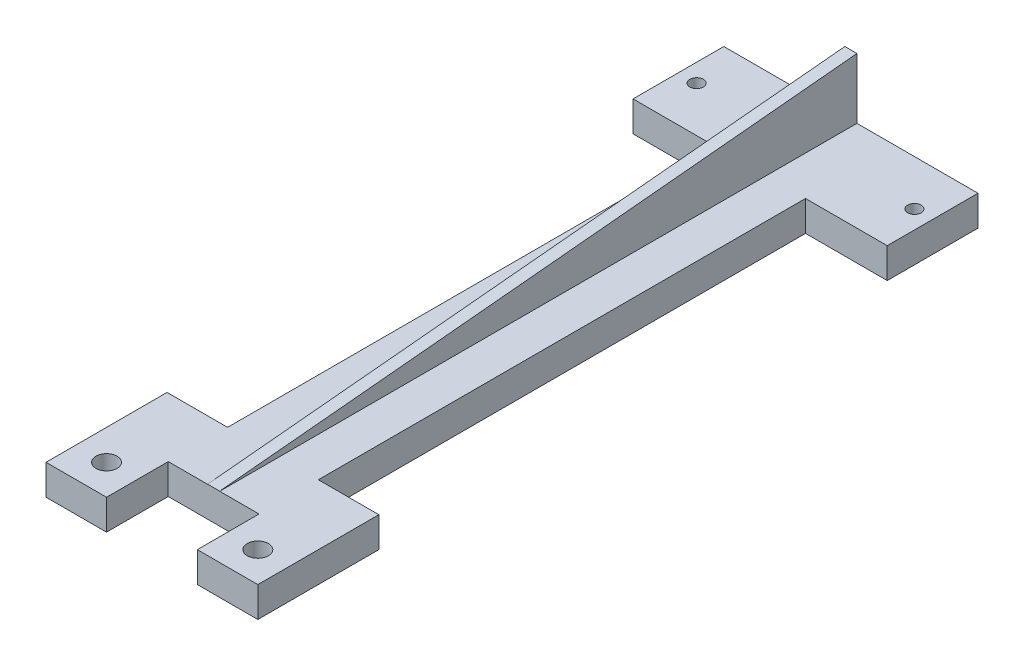
ISO-10303-21;
HEADER;
FILE_DESCRIPTION(('STEP AP214'),'2;1');
FILE_NAME('part.step','',(''),(''),'','','');
FILE_SCHEMA(('AUTOMOTIVE_DESIGN { 1 0 10303 214 1 1 1 1 }'));
ENDSEC;
DATA;
#1=APPLICATION_CONTEXT('core data for automotive mechanical design processes');
#2=APPLICATION_PROTOCOL_DEFINITION('international standard','automotive_design',2000,#1);
#3=PRODUCT_CONTEXT('',#1,'mechanical');
#4=PRODUCT('Part','Part','',(#3));
#5=PRODUCT_RELATED_PRODUCT_CATEGORY('part','',(#4));
#6=PRODUCT_DEFINITION_FORMATION('','',#4);
#7=PRODUCT_DEFINITION_CONTEXT('part definition',#1,'design');
#8=PRODUCT_DEFINITION('design','',#6,#7);
#9=PRODUCT_DEFINITION_SHAPE('','',#8);
#10=(LENGTH_UNIT() NAMED_UNIT(*) SI_UNIT(.MILLI.,.METRE.));
#11=(NAMED_UNIT(*) PLANE_ANGLE_UNIT() SI_UNIT($,.RADIAN.));
#12=(NAMED_UNIT(*) SI_UNIT($,.STERADIAN.) SOLID_ANGLE_UNIT());
#13=UNCERTAINTY_MEASURE_WITH_UNIT(LENGTH_MEASURE(1.E-05),#10,'distance_accuracy_value','');
#14=(GEOMETRIC_REPRESENTATION_CONTEXT(3) GLOBAL_UNCERTAINTY_ASSIGNED_CONTEXT((#13)) GLOBAL_UNIT_ASSIGNED_CONTEXT((#10,
#11,#12)) REPRESENTATION_CONTEXT('',''));
#15=CARTESIAN_POINT('',(0.,0.,0.));
#16=DIRECTION('',(0.,0.,1.));
#17=DIRECTION('',(1.,0.,0.));
#18=AXIS2_PLACEMENT_3D('',#15,#16,#17);
#19=CARTESIAN_POINT('',(0.,5.,0.));
#20=DIRECTION('',(0.,-1.,0.));
#21=DIRECTION('',(0.,0.,-1.));
#22=AXIS2_PLACEMENT_3D('',#19,#20,#21);
#23=PLANE('',#22);
#24=CARTESIAN_POINT('',(3.,5.,-7.5));
#25=DIRECTION('',(0.,1.,0.));
#26=DIRECTION('',(0.,0.,1.));
#27=AXIS2_PLACEMENT_3D('',#24,#25,#26);
#28=CIRCLE('',#27,1.115);
#29=CARTESIAN_POINT('',(3.,5.,-6.385));
#30=VERTEX_POINT('',#29);
#31=EDGE_CURVE('E357',#30,#30,#28,.T.);
#32=ORIENTED_EDGE('',*,*,#31,.F.);
#33=EDGE_LOOP('',(#32));
#34=FACE_BOUND('',#33,.T.);
#35=CARTESIAN_POINT('',(8.50000000000001,5.,95.5));
#36=DIRECTION('',(0.,1.,0.));
#37=DIRECTION('',(0.,0.,1.));
#38=AXIS2_PLACEMENT_3D('',#35,#36,#37);
#39=CIRCLE('',#38,1.75);
#40=CARTESIAN_POINT('',(8.50000000000001,5.,97.25));
#41=VERTEX_POINT('',#40);
#42=EDGE_CURVE('E237',#41,#41,#39,.T.);
#43=ORIENTED_EDGE('',*,*,#42,.F.);
#44=EDGE_LOOP('',(#43));
#45=FACE_BOUND('',#44,.T.);
#46=DIRECTION('',(0.,0.,1.));
#47=VECTOR('',#46,1.);
#48=CARTESIAN_POINT('',(20.,5.,-15.));
#49=LINE('',#48,#47);
#50=CARTESIAN_POINT('',(20.,5.,-15.));
#51=VERTEX_POINT('',#50);
#52=CARTESIAN_POINT('',(20.,5.,90.3));
#53=VERTEX_POINT('',#52);
#54=EDGE_CURVE('E57',#51,#53,#49,.T.);
#55=ORIENTED_EDGE('',*,*,#54,.F.);
#56=DIRECTION('',(-1.,0.,0.));
#57=VECTOR('',#56,1.);
#58=CARTESIAN_POINT('',(0.,5.,-15.));
#59=LINE('',#58,#57);
#60=CARTESIAN_POINT('',(0.,5.,-15.));
#61=VERTEX_POINT('',#60);
#62=EDGE_CURVE('E200',#51,#61,#59,.T.);
#63=ORIENTED_EDGE('',*,*,#62,.T.);
#64=DIRECTION('',(0.,0.,1.));
#65=VECTOR('',#64,1.);
#66=CARTESIAN_POINT('',(0.,5.,0.));
#67=LINE('',#66,#65);
#68=CARTESIAN_POINT('',(0.,5.,0.));
#69=VERTEX_POINT('',#68);
#70=EDGE_CURVE('E368',#61,#69,#67,.T.);
#71=ORIENTED_EDGE('',*,*,#70,.T.);
#72=DIRECTION('',(1.,0.,0.));
#73=VECTOR('',#72,1.);
#74=CARTESIAN_POINT('',(0.,5.,0.));
#75=LINE('',#74,#73);
#76=CARTESIAN_POINT('',(13.5,5.,0.));
#77=VERTEX_POINT('',#76);
#78=EDGE_CURVE('E374',#69,#77,#75,.T.);
#79=ORIENTED_EDGE('',*,*,#78,.T.);
#80=DIRECTION('',(0.,0.,1.));
#81=VECTOR('',#80,1.);
#82=CARTESIAN_POINT('',(13.5,5.,0.));
#83=LINE('',#82,#81);
#84=CARTESIAN_POINT('',(13.5,5.,80.5));
#85=VERTEX_POINT('',#84);
#86=EDGE_CURVE('E307',#77,#85,#83,.T.);
#87=ORIENTED_EDGE('',*,*,#86,.T.);
#88=DIRECTION('',(-1.,0.,0.));
#89=VECTOR('',#88,1.);
#90=CARTESIAN_POINT('',(3.50000000000001,5.,80.5));
#91=LINE('',#90,#89);
#92=CARTESIAN_POINT('',(3.50000000000001,5.,80.5));
#93=VERTEX_POINT('',#92);
#94=EDGE_CURVE('E298',#85,#93,#91,.T.);
#95=ORIENTED_EDGE('',*,*,#94,.T.);
#96=DIRECTION('',(0.,0.,1.));
#97=VECTOR('',#96,1.);
#98=CARTESIAN_POINT('',(3.50000000000001,5.,80.5));
#99=LINE('',#98,#97);
#100=CARTESIAN_POINT('',(3.50000000000002,5.,100.5));
#101=VERTEX_POINT('',#100);
#102=EDGE_CURVE('E292',#93,#101,#99,.T.);
#103=ORIENTED_EDGE('',*,*,#102,.T.);
#104=DIRECTION('',(1.,0.,0.));
#105=VECTOR('',#104,1.);
#106=CARTESIAN_POINT('',(3.50000000000002,5.,100.5));
#107=LINE('',#106,#105);
#108=CARTESIAN_POINT('',(13.5,5.,100.5));
#109=VERTEX_POINT('',#108);
#110=EDGE_CURVE('E267',#101,#109,#107,.T.);
#111=ORIENTED_EDGE('',*,*,#110,.T.);
#112=DIRECTION('',(0.,0.,-1.));
#113=VECTOR('',#112,1.);
#114=CARTESIAN_POINT('',(13.5,5.,90.5));
#115=LINE('',#114,#113);
#116=CARTESIAN_POINT('',(13.5,5.,90.3));
#117=VERTEX_POINT('',#116);
#118=EDGE_CURVE('E271',#109,#117,#115,.T.);
#119=ORIENTED_EDGE('',*,*,#118,.T.);
#120=DIRECTION('',(-1.,0.,0.));
#121=VECTOR('',#120,1.);
#122=CARTESIAN_POINT('',(13.5,5.,90.3));
#123=LINE('',#122,#121);
#124=EDGE_CURVE('E214',#53,#117,#123,.T.);
#125=ORIENTED_EDGE('',*,*,#124,.F.);
#126=EDGE_LOOP('',(#55,#63,#71,#79,#87,#95,#103,#111,#119,#125));
#127=FACE_BOUND('',#126,.T.);
#128=ADVANCED_FACE('F41',(#34,#45,#127),#23,.F.);
#129=CARTESIAN_POINT('',(39.,5.,-7.5));
#130=DIRECTION('',(0.,1.,0.));
#131=DIRECTION('',(0.,0.,1.));
#132=AXIS2_PLACEMENT_3D('',#129,#130,#131);
#133=CIRCLE('',#132,1.115);
#134=CARTESIAN_POINT('',(39.,5.,-6.385));
#135=VERTEX_POINT('',#134);
#136=EDGE_CURVE('E351',#135,#135,#133,.T.);
#137=ORIENTED_EDGE('',*,*,#136,.F.);
#138=EDGE_LOOP('',(#137));
#139=FACE_BOUND('',#138,.T.);
#140=DIRECTION('',(0.,0.,1.));
#141=VECTOR('',#140,1.);
#142=CARTESIAN_POINT('',(28.5,5.,90.5));
#143=LINE('',#142,#141);
#144=CARTESIAN_POINT('',(28.5,5.,90.3));
#145=VERTEX_POINT('',#144);
#146=CARTESIAN_POINT('',(28.5,5.,100.5));
#147=VERTEX_POINT('',#146);
#148=EDGE_CURVE('E236',#145,#147,#143,.T.);
#149=ORIENTED_EDGE('',*,*,#148,.T.);
#150=DIRECTION('',(1.,0.,0.));
#151=VECTOR('',#150,1.);
#152=CARTESIAN_POINT('',(38.5,5.,100.5));
#153=LINE('',#152,#151);
#154=CARTESIAN_POINT('',(38.5,5.,100.5));
#155=VERTEX_POINT('',#154);
#156=EDGE_CURVE('E248',#147,#155,#153,.T.);
#157=ORIENTED_EDGE('',*,*,#156,.T.);
#158=DIRECTION('',(0.,0.,-1.));
#159=VECTOR('',#158,1.);
#160=CARTESIAN_POINT('',(38.5,5.,80.5));
#161=LINE('',#160,#159);
#162=CARTESIAN_POINT('',(38.5,5.,80.5));
#163=VERTEX_POINT('',#162);
#164=EDGE_CURVE('E299',#155,#163,#161,.T.);
#165=ORIENTED_EDGE('',*,*,#164,.T.);
#166=CARTESIAN_POINT('',(28.5,5.,80.5));
#167=VERTEX_POINT('',#166);
#168=EDGE_CURVE('E293',#163,#167,#91,.T.);
#169=ORIENTED_EDGE('',*,*,#168,.T.);
#170=DIRECTION('',(0.,0.,-1.));
#171=VECTOR('',#170,1.);
#172=CARTESIAN_POINT('',(28.5,5.,0.));
#173=LINE('',#172,#171);
#174=CARTESIAN_POINT('',(28.5,5.,0.));
#175=VERTEX_POINT('',#174);
#176=EDGE_CURVE('E324',#167,#175,#173,.T.);
#177=ORIENTED_EDGE('',*,*,#176,.T.);
#178=CARTESIAN_POINT('',(42.,5.,0.));
#179=VERTEX_POINT('',#178);
#180=EDGE_CURVE('E372',#175,#179,#75,.T.);
#181=ORIENTED_EDGE('',*,*,#180,.T.);
#182=DIRECTION('',(0.,0.,-1.));
#183=VECTOR('',#182,1.);
#184=CARTESIAN_POINT('',(42.,5.,0.));
#185=LINE('',#184,#183);
#186=CARTESIAN_POINT('',(42.,5.,-15.));
#187=VERTEX_POINT('',#186);
#188=EDGE_CURVE('E378',#179,#187,#185,.T.);
#189=ORIENTED_EDGE('',*,*,#188,.T.);
#190=CARTESIAN_POINT('',(22.,5.,-15.));
#191=VERTEX_POINT('',#190);
#192=EDGE_CURVE('E381',#187,#191,#59,.T.);
#193=ORIENTED_EDGE('',*,*,#192,.T.);
#194=DIRECTION('',(0.,0.,-1.));
#195=VECTOR('',#194,1.);
#196=CARTESIAN_POINT('',(22.,5.,-15.));
#197=LINE('',#196,#195);
#198=CARTESIAN_POINT('',(22.,5.,90.3));
#199=VERTEX_POINT('',#198);
#200=EDGE_CURVE('E191',#199,#191,#197,.T.);
#201=ORIENTED_EDGE('',*,*,#200,.F.);
#202=EDGE_CURVE('E220',#145,#199,#123,.T.);
#203=ORIENTED_EDGE('',*,*,#202,.F.);
#204=EDGE_LOOP('',(#149,#157,#165,#169,#177,#181,#189,#193,#201,#203));
#205=FACE_BOUND('',#204,.T.);
#206=CARTESIAN_POINT('',(33.5,5.,95.5));
#207=DIRECTION('',(0.,1.,0.));
#208=DIRECTION('',(0.,0.,1.));
#209=AXIS2_PLACEMENT_3D('',#206,#207,#208);
#210=CIRCLE('',#209,1.75);
#211=CARTESIAN_POINT('',(33.5,5.,97.25));
#212=VERTEX_POINT('',#211);
#213=EDGE_CURVE('E228',#212,#212,#210,.T.);
#214=ORIENTED_EDGE('',*,*,#213,.F.);
#215=EDGE_LOOP('',(#214));
#216=FACE_BOUND('',#215,.T.);
#217=ADVANCED_FACE('F447',(#139,#205,#216),#23,.F.);
#218=CARTESIAN_POINT('',(0.,5.,0.));
#219=DIRECTION('',(0.,0.,-1.));
#220=DIRECTION('',(-1.,0.,0.));
#221=AXIS2_PLACEMENT_3D('',#218,#219,#220);
#222=PLANE('',#221);
#223=DIRECTION('',(0.,1.,0.));
#224=VECTOR('',#223,1.);
#225=CARTESIAN_POINT('',(28.5,-81.8855909180608,0.));
#226=LINE('',#225,#224);
#227=CARTESIAN_POINT('',(28.5,0.,0.));
#228=VERTEX_POINT('',#227);
#229=EDGE_CURVE('E340',#228,#175,#226,.T.);
#230=ORIENTED_EDGE('',*,*,#229,.F.);
#231=DIRECTION('',(1.,0.,0.));
#232=VECTOR('',#231,1.);
#233=CARTESIAN_POINT('',(0.,0.,0.));
#234=LINE('',#233,#232);
#235=CARTESIAN_POINT('',(42.,0.,0.));
#236=VERTEX_POINT('',#235);
#237=EDGE_CURVE('E388',#228,#236,#234,.T.);
#238=ORIENTED_EDGE('',*,*,#237,.T.);
#239=DIRECTION('',(0.,-1.,0.));
#240=VECTOR('',#239,1.);
#241=CARTESIAN_POINT('',(42.,5.,0.));
#242=LINE('',#241,#240);
#243=EDGE_CURVE('E50',#179,#236,#242,.T.);
#244=ORIENTED_EDGE('',*,*,#243,.F.);
#245=ORIENTED_EDGE('',*,*,#180,.F.);
#246=EDGE_LOOP('',(#230,#238,#244,#245));
#247=FACE_BOUND('',#246,.T.);
#248=ADVANCED_FACE('F473',(#247),#222,.F.);
#249=CARTESIAN_POINT('',(0.,5.,0.));
#250=DIRECTION('',(1.,0.,0.));
#251=DIRECTION('',(0.,0.,-1.));
#252=AXIS2_PLACEMENT_3D('',#249,#250,#251);
#253=PLANE('',#252);
#254=DIRECTION('',(0.,0.,1.));
#255=VECTOR('',#254,1.);
#256=CARTESIAN_POINT('',(0.,0.,0.));
#257=LINE('',#256,#255);
#258=CARTESIAN_POINT('',(0.,0.,-15.));
#259=VERTEX_POINT('',#258);
#260=CARTESIAN_POINT('',(0.,0.,0.));
#261=VERTEX_POINT('',#260);
#262=EDGE_CURVE('E356',#259,#261,#257,.T.);
#263=ORIENTED_EDGE('',*,*,#262,.T.);
#264=DIRECTION('',(0.,-1.,0.));
#265=VECTOR('',#264,1.);
#266=CARTESIAN_POINT('',(0.,5.,0.));
#267=LINE('',#266,#265);
#268=EDGE_CURVE('E11',#69,#261,#267,.T.);
#269=ORIENTED_EDGE('',*,*,#268,.F.);
#270=ORIENTED_EDGE('',*,*,#70,.F.);
#271=DIRECTION('',(0.,-1.,0.));
#272=VECTOR('',#271,1.);
#273=CARTESIAN_POINT('',(0.,5.,-15.));
#274=LINE('',#273,#272);
#275=EDGE_CURVE('E384',#61,#259,#274,.T.);
#276=ORIENTED_EDGE('',*,*,#275,.T.);
#277=EDGE_LOOP('',(#263,#269,#270,#276));
#278=FACE_BOUND('',#277,.T.);
#279=ADVANCED_FACE('F43',(#278),#253,.F.);
#280=CARTESIAN_POINT('',(13.5,0.,0.));
#281=VERTEX_POINT('',#280);
#282=EDGE_CURVE('E389',#261,#281,#234,.T.);
#283=ORIENTED_EDGE('',*,*,#282,.T.);
#284=DIRECTION('',(0.,1.,0.));
#285=VECTOR('',#284,1.);
#286=CARTESIAN_POINT('',(13.5,-81.8855909180608,0.));
#287=LINE('',#286,#285);
#288=EDGE_CURVE('E336',#281,#77,#287,.T.);
#289=ORIENTED_EDGE('',*,*,#288,.T.);
#290=ORIENTED_EDGE('',*,*,#78,.F.);
#291=ORIENTED_EDGE('',*,*,#268,.T.);
#292=EDGE_LOOP('',(#283,#289,#290,#291));
#293=FACE_BOUND('',#292,.T.);
#294=ADVANCED_FACE('F486',(#293),#222,.F.);
#295=CARTESIAN_POINT('',(42.,5.,0.));
#296=DIRECTION('',(-1.,0.,0.));
#297=DIRECTION('',(0.,0.,1.));
#298=AXIS2_PLACEMENT_3D('',#295,#296,#297);
#299=PLANE('',#298);
#300=DIRECTION('',(0.,0.,-1.));
#301=VECTOR('',#300,1.);
#302=CARTESIAN_POINT('',(42.,0.,0.));
#303=LINE('',#302,#301);
#304=CARTESIAN_POINT('',(42.,0.,-15.));
#305=VERTEX_POINT('',#304);
#306=EDGE_CURVE('E393',#236,#305,#303,.T.);
#307=ORIENTED_EDGE('',*,*,#306,.T.);
#308=DIRECTION('',(0.,-1.,0.));
#309=VECTOR('',#308,1.);
#310=CARTESIAN_POINT('',(42.,5.,-15.));
#311=LINE('',#310,#309);
#312=EDGE_CURVE('E401',#187,#305,#311,.T.);
#313=ORIENTED_EDGE('',*,*,#312,.F.);
#314=ORIENTED_EDGE('',*,*,#188,.F.);
#315=ORIENTED_EDGE('',*,*,#243,.T.);
#316=EDGE_LOOP('',(#307,#313,#314,#315));
#317=FACE_BOUND('',#316,.T.);
#318=ADVANCED_FACE('F410',(#317),#299,.F.);
#319=CARTESIAN_POINT('',(0.,5.,-15.));
#320=DIRECTION('',(0.,0.,1.));
#321=DIRECTION('',(1.,0.,0.));
#322=AXIS2_PLACEMENT_3D('',#319,#320,#321);
#323=PLANE('',#322);
#324=DIRECTION('',(-1.,0.,0.));
#325=VECTOR('',#324,1.);
#326=CARTESIAN_POINT('',(0.,0.,-15.));
#327=LINE('',#326,#325);
#328=EDGE_CURVE('E373',#305,#259,#327,.T.);
#329=ORIENTED_EDGE('',*,*,#328,.T.);
#330=ORIENTED_EDGE('',*,*,#275,.F.);
#331=ORIENTED_EDGE('',*,*,#62,.F.);
#332=DIRECTION('',(0.,-1.,0.));
#333=VECTOR('',#332,1.);
#334=CARTESIAN_POINT('',(20.,15.,-15.));
#335=LINE('',#334,#333);
#336=CARTESIAN_POINT('',(20.,15.,-15.));
#337=VERTEX_POINT('',#336);
#338=EDGE_CURVE('E190',#337,#51,#335,.T.);
#339=ORIENTED_EDGE('',*,*,#338,.F.);
#340=DIRECTION('',(-1.,0.,0.));
#341=VECTOR('',#340,1.);
#342=CARTESIAN_POINT('',(20.,15.,-15.));
#343=LINE('',#342,#341);
#344=CARTESIAN_POINT('',(22.,15.,-15.));
#345=VERTEX_POINT('',#344);
#346=EDGE_CURVE('E179',#345,#337,#343,.T.);
#347=ORIENTED_EDGE('',*,*,#346,.F.);
#348=DIRECTION('',(0.,-1.,0.));
#349=VECTOR('',#348,1.);
#350=CARTESIAN_POINT('',(22.,15.,-15.));
#351=LINE('',#350,#349);
#352=EDGE_CURVE('E202',#345,#191,#351,.T.);
#353=ORIENTED_EDGE('',*,*,#352,.T.);
#354=ORIENTED_EDGE('',*,*,#192,.F.);
#355=ORIENTED_EDGE('',*,*,#312,.T.);
#356=EDGE_LOOP('',(#329,#330,#331,#339,#347,#353,#354,#355));
#357=FACE_BOUND('',#356,.T.);
#358=ADVANCED_FACE('F198',(#357),#323,.F.);
#359=CARTESIAN_POINT('',(0.,0.,0.));
#360=DIRECTION('',(0.,-1.,0.));
#361=DIRECTION('',(0.,0.,-1.));
#362=AXIS2_PLACEMENT_3D('',#359,#360,#361);
#363=PLANE('',#362);
#364=DIRECTION('',(-1.,0.,0.));
#365=VECTOR('',#364,1.);
#366=CARTESIAN_POINT('',(13.5,0.,90.3));
#367=LINE('',#366,#365);
#368=CARTESIAN_POINT('',(28.5,0.,90.3));
#369=VERTEX_POINT('',#368);
#370=CARTESIAN_POINT('',(13.5,0.,90.3));
#371=VERTEX_POINT('',#370);
#372=EDGE_CURVE('E215',#369,#371,#367,.T.);
#373=ORIENTED_EDGE('',*,*,#372,.T.);
#374=DIRECTION('',(0.,0.,-1.));
#375=VECTOR('',#374,1.);
#376=CARTESIAN_POINT('',(13.5,0.,90.5));
#377=LINE('',#376,#375);
#378=CARTESIAN_POINT('',(13.5,0.,100.5));
#379=VERTEX_POINT('',#378);
#380=EDGE_CURVE('E283',#379,#371,#377,.T.);
#381=ORIENTED_EDGE('',*,*,#380,.F.);
#382=DIRECTION('',(1.,0.,0.));
#383=VECTOR('',#382,1.);
#384=CARTESIAN_POINT('',(3.50000000000002,0.,100.5));
#385=LINE('',#384,#383);
#386=CARTESIAN_POINT('',(3.50000000000002,0.,100.5));
#387=VERTEX_POINT('',#386);
#388=EDGE_CURVE('E275',#387,#379,#385,.T.);
#389=ORIENTED_EDGE('',*,*,#388,.F.);
#390=DIRECTION('',(0.,0.,1.));
#391=VECTOR('',#390,1.);
#392=CARTESIAN_POINT('',(3.50000000000001,0.,80.5));
#393=LINE('',#392,#391);
#394=CARTESIAN_POINT('',(3.50000000000001,0.,80.5));
#395=VERTEX_POINT('',#394);
#396=EDGE_CURVE('E304',#395,#387,#393,.T.);
#397=ORIENTED_EDGE('',*,*,#396,.F.);
#398=DIRECTION('',(-1.,0.,0.));
#399=VECTOR('',#398,1.);
#400=CARTESIAN_POINT('',(3.50000000000001,0.,80.5));
#401=LINE('',#400,#399);
#402=CARTESIAN_POINT('',(13.5,0.,80.5));
#403=VERTEX_POINT('',#402);
#404=EDGE_CURVE('E313',#403,#395,#401,.T.);
#405=ORIENTED_EDGE('',*,*,#404,.F.);
#406=DIRECTION('',(0.,0.,1.));
#407=VECTOR('',#406,1.);
#408=CARTESIAN_POINT('',(13.5,0.,0.));
#409=LINE('',#408,#407);
#410=EDGE_CURVE('E332',#281,#403,#409,.T.);
#411=ORIENTED_EDGE('',*,*,#410,.F.);
#412=ORIENTED_EDGE('',*,*,#282,.F.);
#413=ORIENTED_EDGE('',*,*,#262,.F.);
#414=ORIENTED_EDGE('',*,*,#328,.F.);
#415=ORIENTED_EDGE('',*,*,#306,.F.);
#416=ORIENTED_EDGE('',*,*,#237,.F.);
#417=DIRECTION('',(0.,0.,-1.));
#418=VECTOR('',#417,1.);
#419=CARTESIAN_POINT('',(28.5,0.,0.));
#420=LINE('',#419,#418);
#421=CARTESIAN_POINT('',(28.5,0.,80.5));
#422=VERTEX_POINT('',#421);
#423=EDGE_CURVE('E337',#422,#228,#420,.T.);
#424=ORIENTED_EDGE('',*,*,#423,.F.);
#425=CARTESIAN_POINT('',(38.5,0.,80.5));
#426=VERTEX_POINT('',#425);
#427=EDGE_CURVE('E309',#426,#422,#401,.T.);
#428=ORIENTED_EDGE('',*,*,#427,.F.);
#429=DIRECTION('',(0.,0.,-1.));
#430=VECTOR('',#429,1.);
#431=CARTESIAN_POINT('',(38.5,0.,80.5));
#432=LINE('',#431,#430);
#433=CARTESIAN_POINT('',(38.5,0.,100.5));
#434=VERTEX_POINT('',#433);
#435=EDGE_CURVE('E297',#434,#426,#432,.T.);
#436=ORIENTED_EDGE('',*,*,#435,.F.);
#437=DIRECTION('',(1.,0.,0.));
#438=VECTOR('',#437,1.);
#439=CARTESIAN_POINT('',(38.5,0.,100.5));
#440=LINE('',#439,#438);
#441=CARTESIAN_POINT('',(28.5,0.,100.5));
#442=VERTEX_POINT('',#441);
#443=EDGE_CURVE('E255',#442,#434,#440,.T.);
#444=ORIENTED_EDGE('',*,*,#443,.F.);
#445=DIRECTION('',(0.,0.,1.));
#446=VECTOR('',#445,1.);
#447=CARTESIAN_POINT('',(28.5,0.,90.5));
#448=LINE('',#447,#446);
#449=EDGE_CURVE('E252',#369,#442,#448,.T.);
#450=ORIENTED_EDGE('',*,*,#449,.F.);
#451=EDGE_LOOP('',(#373,#381,#389,#397,#405,#411,#412,#413,#414,#415,#416,#424,#428,#436,#444,#450));
#452=FACE_BOUND('',#451,.T.);
#453=CARTESIAN_POINT('',(8.50000000000001,0.,95.5));
#454=DIRECTION('',(0.,1.,0.));
#455=DIRECTION('',(0.,0.,1.));
#456=AXIS2_PLACEMENT_3D('',#453,#454,#455);
#457=CIRCLE('',#456,1.75);
#458=CARTESIAN_POINT('',(8.50000000000001,0.,97.25));
#459=VERTEX_POINT('',#458);
#460=EDGE_CURVE('E232',#459,#459,#457,.T.);
#461=ORIENTED_EDGE('',*,*,#460,.T.);
#462=EDGE_LOOP('',(#461));
#463=FACE_BOUND('',#462,.T.);
#464=CARTESIAN_POINT('',(33.5,0.,95.5));
#465=DIRECTION('',(0.,1.,0.));
#466=DIRECTION('',(0.,0.,1.));
#467=AXIS2_PLACEMENT_3D('',#464,#465,#466);
#468=CIRCLE('',#467,1.75);
#469=CARTESIAN_POINT('',(33.5,0.,97.25));
#470=VERTEX_POINT('',#469);
#471=EDGE_CURVE('E241',#470,#470,#468,.T.);
#472=ORIENTED_EDGE('',*,*,#471,.T.);
#473=EDGE_LOOP('',(#472));
#474=FACE_BOUND('',#473,.T.);
#475=CARTESIAN_POINT('',(3.,0.,-7.5));
#476=DIRECTION('',(0.,1.,0.));
#477=DIRECTION('',(0.,0.,1.));
#478=AXIS2_PLACEMENT_3D('',#475,#476,#477);
#479=CIRCLE('',#478,1.115);
#480=CARTESIAN_POINT('',(3.,0.,-6.385));
#481=VERTEX_POINT('',#480);
#482=EDGE_CURVE('E352',#481,#481,#479,.T.);
#483=ORIENTED_EDGE('',*,*,#482,.T.);
#484=EDGE_LOOP('',(#483));
#485=FACE_BOUND('',#484,.T.);
#486=CARTESIAN_POINT('',(39.,0.,-7.5));
#487=DIRECTION('',(0.,1.,0.));
#488=DIRECTION('',(0.,0.,1.));
#489=AXIS2_PLACEMENT_3D('',#486,#487,#488);
#490=CIRCLE('',#489,1.115);
#491=CARTESIAN_POINT('',(39.,0.,-6.385));
#492=VERTEX_POINT('',#491);
#493=EDGE_CURVE('E361',#492,#492,#490,.T.);
#494=ORIENTED_EDGE('',*,*,#493,.T.);
#495=EDGE_LOOP('',(#494));
#496=FACE_BOUND('',#495,.T.);
#497=ADVANCED_FACE('F417',(#452,#463,#474,#485,#496),#363,.T.);
#498=CARTESIAN_POINT('',(39.,0.,-7.5));
#499=DIRECTION('',(0.,1.,0.));
#500=DIRECTION('',(0.,0.,1.));
#501=AXIS2_PLACEMENT_3D('',#498,#499,#500);
#502=CYLINDRICAL_SURFACE('',#501,1.115);
#503=ORIENTED_EDGE('',*,*,#493,.F.);
#504=EDGE_LOOP('',(#503));
#505=FACE_BOUND('',#504,.T.);
#506=ORIENTED_EDGE('',*,*,#136,.T.);
#507=EDGE_LOOP('',(#506));
#508=FACE_BOUND('',#507,.T.);
#509=ADVANCED_FACE('F479',(#505,#508),#502,.F.);
#510=CARTESIAN_POINT('',(3.,0.,-7.5));
#511=DIRECTION('',(0.,1.,0.));
#512=DIRECTION('',(0.,0.,1.));
#513=AXIS2_PLACEMENT_3D('',#510,#511,#512);
#514=CYLINDRICAL_SURFACE('',#513,1.115);
#515=ORIENTED_EDGE('',*,*,#482,.F.);
#516=EDGE_LOOP('',(#515));
#517=FACE_BOUND('',#516,.T.);
#518=ORIENTED_EDGE('',*,*,#31,.T.);
#519=EDGE_LOOP('',(#518));
#520=FACE_BOUND('',#519,.T.);
#521=ADVANCED_FACE('F540',(#517,#520),#514,.F.);
#522=CARTESIAN_POINT('',(28.5,-81.8855909180608,0.));
#523=DIRECTION('',(1.,0.,0.));
#524=DIRECTION('',(0.,0.,-1.));
#525=AXIS2_PLACEMENT_3D('',#522,#523,#524);
#526=PLANE('',#525);
#527=DIRECTION('',(0.,1.,0.));
#528=VECTOR('',#527,1.);
#529=CARTESIAN_POINT('',(28.5,-81.8855909180608,80.5));
#530=LINE('',#529,#528);
#531=EDGE_CURVE('E328',#422,#167,#530,.T.);
#532=ORIENTED_EDGE('',*,*,#531,.F.);
#533=ORIENTED_EDGE('',*,*,#423,.T.);
#534=ORIENTED_EDGE('',*,*,#229,.T.);
#535=ORIENTED_EDGE('',*,*,#176,.F.);
#536=EDGE_LOOP('',(#532,#533,#534,#535));
#537=FACE_BOUND('',#536,.T.);
#538=ADVANCED_FACE('F498',(#537),#526,.T.);
#539=CARTESIAN_POINT('',(13.5,-81.8855909180608,0.));
#540=DIRECTION('',(-1.,0.,0.));
#541=DIRECTION('',(0.,0.,1.));
#542=AXIS2_PLACEMENT_3D('',#539,#540,#541);
#543=PLANE('',#542);
#544=ORIENTED_EDGE('',*,*,#288,.F.);
#545=ORIENTED_EDGE('',*,*,#410,.T.);
#546=DIRECTION('',(0.,1.,0.));
#547=VECTOR('',#546,1.);
#548=CARTESIAN_POINT('',(13.5,-81.8855909180608,80.5));
#549=LINE('',#548,#547);
#550=EDGE_CURVE('E335',#403,#85,#549,.T.);
#551=ORIENTED_EDGE('',*,*,#550,.T.);
#552=ORIENTED_EDGE('',*,*,#86,.F.);
#553=EDGE_LOOP('',(#544,#545,#551,#552));
#554=FACE_BOUND('',#553,.T.);
#555=ADVANCED_FACE('F535',(#554),#543,.T.);
#556=CARTESIAN_POINT('',(3.50000000000001,-36.4005494464026,80.5));
#557=DIRECTION('',(0.,0.,-1.));
#558=DIRECTION('',(-1.,0.,0.));
#559=AXIS2_PLACEMENT_3D('',#556,#557,#558);
#560=PLANE('',#559);
#561=ORIENTED_EDGE('',*,*,#550,.F.);
#562=ORIENTED_EDGE('',*,*,#404,.T.);
#563=DIRECTION('',(0.,1.,0.));
#564=VECTOR('',#563,1.);
#565=CARTESIAN_POINT('',(3.50000000000001,-36.4005494464026,80.5));
#566=LINE('',#565,#564);
#567=EDGE_CURVE('E308',#395,#93,#566,.T.);
#568=ORIENTED_EDGE('',*,*,#567,.T.);
#569=ORIENTED_EDGE('',*,*,#94,.F.);
#570=EDGE_LOOP('',(#561,#562,#568,#569));
#571=FACE_BOUND('',#570,.T.);
#572=ADVANCED_FACE('F532',(#571),#560,.T.);
#573=CARTESIAN_POINT('',(38.5,-36.4005494464026,80.5));
#574=DIRECTION('',(1.,0.,0.));
#575=DIRECTION('',(0.,0.,-1.));
#576=AXIS2_PLACEMENT_3D('',#573,#574,#575);
#577=PLANE('',#576);
#578=ORIENTED_EDGE('',*,*,#164,.F.);
#579=DIRECTION('',(0.,1.,0.));
#580=VECTOR('',#579,1.);
#581=CARTESIAN_POINT('',(38.5,-14.142135623731,100.5));
#582=LINE('',#581,#580);
#583=EDGE_CURVE('E259',#434,#155,#582,.T.);
#584=ORIENTED_EDGE('',*,*,#583,.F.);
#585=ORIENTED_EDGE('',*,*,#435,.T.);
#586=DIRECTION('',(0.,1.,0.));
#587=VECTOR('',#586,1.);
#588=CARTESIAN_POINT('',(38.5,-36.4005494464026,80.5));
#589=LINE('',#588,#587);
#590=EDGE_CURVE('E317',#426,#163,#589,.T.);
#591=ORIENTED_EDGE('',*,*,#590,.T.);
#592=EDGE_LOOP('',(#578,#584,#585,#591));
#593=FACE_BOUND('',#592,.T.);
#594=ADVANCED_FACE('F506',(#593),#577,.T.);
#595=ORIENTED_EDGE('',*,*,#427,.T.);
#596=ORIENTED_EDGE('',*,*,#531,.T.);
#597=ORIENTED_EDGE('',*,*,#168,.F.);
#598=ORIENTED_EDGE('',*,*,#590,.F.);
#599=EDGE_LOOP('',(#595,#596,#597,#598));
#600=FACE_BOUND('',#599,.T.);
#601=ADVANCED_FACE('F502',(#600),#560,.T.);
#602=CARTESIAN_POINT('',(3.50000000000001,-36.4005494464026,80.5));
#603=DIRECTION('',(-1.,0.,0.));
#604=DIRECTION('',(0.,0.,1.));
#605=AXIS2_PLACEMENT_3D('',#602,#603,#604);
#606=PLANE('',#605);
#607=ORIENTED_EDGE('',*,*,#567,.F.);
#608=ORIENTED_EDGE('',*,*,#396,.T.);
#609=DIRECTION('',(0.,1.,0.));
#610=VECTOR('',#609,1.);
#611=CARTESIAN_POINT('',(3.50000000000002,-14.142135623731,100.5));
#612=LINE('',#611,#610);
#613=EDGE_CURVE('E286',#387,#101,#612,.T.);
#614=ORIENTED_EDGE('',*,*,#613,.T.);
#615=ORIENTED_EDGE('',*,*,#102,.F.);
#616=EDGE_LOOP('',(#607,#608,#614,#615));
#617=FACE_BOUND('',#616,.T.);
#618=ADVANCED_FACE('F525',(#617),#606,.T.);
#619=CARTESIAN_POINT('',(3.50000000000002,-14.142135623731,100.5));
#620=DIRECTION('',(0.,0.,1.));
#621=DIRECTION('',(1.,0.,0.));
#622=AXIS2_PLACEMENT_3D('',#619,#620,#621);
#623=PLANE('',#622);
#624=ORIENTED_EDGE('',*,*,#613,.F.);
#625=ORIENTED_EDGE('',*,*,#388,.T.);
#626=DIRECTION('',(0.,1.,0.));
#627=VECTOR('',#626,1.);
#628=CARTESIAN_POINT('',(13.5,-14.142135623731,100.5));
#629=LINE('',#628,#627);
#630=EDGE_CURVE('E282',#379,#109,#629,.T.);
#631=ORIENTED_EDGE('',*,*,#630,.T.);
#632=ORIENTED_EDGE('',*,*,#110,.F.);
#633=EDGE_LOOP('',(#624,#625,#631,#632));
#634=FACE_BOUND('',#633,.T.);
#635=ADVANCED_FACE('F519',(#634),#623,.T.);
#636=CARTESIAN_POINT('',(13.5,-14.142135623731,90.5));
#637=DIRECTION('',(1.,0.,0.));
#638=DIRECTION('',(0.,0.,-1.));
#639=AXIS2_PLACEMENT_3D('',#636,#637,#638);
#640=PLANE('',#639);
#641=ORIENTED_EDGE('',*,*,#630,.F.);
#642=ORIENTED_EDGE('',*,*,#380,.T.);
#643=DIRECTION('',(0.,1.,0.));
#644=VECTOR('',#643,1.);
#645=CARTESIAN_POINT('',(13.5,0.,90.3));
#646=LINE('',#645,#644);
#647=EDGE_CURVE('E224',#371,#117,#646,.T.);
#648=ORIENTED_EDGE('',*,*,#647,.T.);
#649=ORIENTED_EDGE('',*,*,#118,.F.);
#650=EDGE_LOOP('',(#641,#642,#648,#649));
#651=FACE_BOUND('',#650,.T.);
#652=ADVANCED_FACE('F438',(#651),#640,.T.);
#653=CARTESIAN_POINT('',(28.5,-14.142135623731,90.5));
#654=DIRECTION('',(-1.,0.,0.));
#655=DIRECTION('',(0.,0.,1.));
#656=AXIS2_PLACEMENT_3D('',#653,#654,#655);
#657=PLANE('',#656);
#658=ORIENTED_EDGE('',*,*,#148,.F.);
#659=DIRECTION('',(0.,1.,0.));
#660=VECTOR('',#659,1.);
#661=CARTESIAN_POINT('',(28.5,0.,90.3));
#662=LINE('',#661,#660);
#663=EDGE_CURVE('E219',#369,#145,#662,.T.);
#664=ORIENTED_EDGE('',*,*,#663,.F.);
#665=ORIENTED_EDGE('',*,*,#449,.T.);
#666=DIRECTION('',(0.,1.,0.));
#667=VECTOR('',#666,1.);
#668=CARTESIAN_POINT('',(28.5,-14.142135623731,100.5));
#669=LINE('',#668,#667);
#670=EDGE_CURVE('E260',#442,#147,#669,.T.);
#671=ORIENTED_EDGE('',*,*,#670,.T.);
#672=EDGE_LOOP('',(#658,#664,#665,#671));
#673=FACE_BOUND('',#672,.T.);
#674=ADVANCED_FACE('F510',(#673),#657,.T.);
#675=CARTESIAN_POINT('',(38.5,-14.142135623731,100.5));
#676=DIRECTION('',(0.,0.,1.));
#677=DIRECTION('',(1.,0.,0.));
#678=AXIS2_PLACEMENT_3D('',#675,#676,#677);
#679=PLANE('',#678);
#680=ORIENTED_EDGE('',*,*,#670,.F.);
#681=ORIENTED_EDGE('',*,*,#443,.T.);
#682=ORIENTED_EDGE('',*,*,#583,.T.);
#683=ORIENTED_EDGE('',*,*,#156,.F.);
#684=EDGE_LOOP('',(#680,#681,#682,#683));
#685=FACE_BOUND('',#684,.T.);
#686=ADVANCED_FACE('F509',(#685),#679,.T.);
#687=CARTESIAN_POINT('',(33.5,0.,95.5));
#688=DIRECTION('',(0.,1.,0.));
#689=DIRECTION('',(0.,0.,1.));
#690=AXIS2_PLACEMENT_3D('',#687,#688,#689);
#691=CYLINDRICAL_SURFACE('',#690,1.75);
#692=ORIENTED_EDGE('',*,*,#471,.F.);
#693=EDGE_LOOP('',(#692));
#694=FACE_BOUND('',#693,.T.);
#695=ORIENTED_EDGE('',*,*,#213,.T.);
#696=EDGE_LOOP('',(#695));
#697=FACE_BOUND('',#696,.T.);
#698=ADVANCED_FACE('F517',(#694,#697),#691,.F.);
#699=CARTESIAN_POINT('',(8.50000000000001,0.,95.5));
#700=DIRECTION('',(0.,1.,0.));
#701=DIRECTION('',(0.,0.,1.));
#702=AXIS2_PLACEMENT_3D('',#699,#700,#701);
#703=CYLINDRICAL_SURFACE('',#702,1.75);
#704=ORIENTED_EDGE('',*,*,#460,.F.);
#705=EDGE_LOOP('',(#704));
#706=FACE_BOUND('',#705,.T.);
#707=ORIENTED_EDGE('',*,*,#42,.T.);
#708=EDGE_LOOP('',(#707));
#709=FACE_BOUND('',#708,.T.);
#710=ADVANCED_FACE('F644',(#706,#709),#703,.F.);
#711=CARTESIAN_POINT('',(13.5,0.,90.3));
#712=DIRECTION('',(0.,0.,-1.));
#713=DIRECTION('',(-1.,0.,0.));
#714=AXIS2_PLACEMENT_3D('',#711,#712,#713);
#715=PLANE('',#714);
#716=DIRECTION('',(0.,-1.,0.));
#717=VECTOR('',#716,1.);
#718=CARTESIAN_POINT('',(22.,15.,90.3));
#719=LINE('',#718,#717);
#720=CARTESIAN_POINT('',(22.,5.01895734597157,90.3));
#721=VERTEX_POINT('',#720);
#722=EDGE_CURVE('E205',#721,#199,#719,.T.);
#723=ORIENTED_EDGE('',*,*,#722,.F.);
#724=DIRECTION('',(-1.,0.,0.));
#725=VECTOR('',#724,1.);
#726=CARTESIAN_POINT('',(13.5,5.01895734597157,90.3));
#727=LINE('',#726,#725);
#728=CARTESIAN_POINT('',(20.,5.01895734597156,90.3));
#729=VERTEX_POINT('',#728);
#730=EDGE_CURVE('E453',#721,#729,#727,.T.);
#731=ORIENTED_EDGE('',*,*,#730,.T.);
#732=DIRECTION('',(0.,-1.,0.));
#733=VECTOR('',#732,1.);
#734=CARTESIAN_POINT('',(20.,15.,90.3));
#735=LINE('',#734,#733);
#736=EDGE_CURVE('E65',#729,#53,#735,.T.);
#737=ORIENTED_EDGE('',*,*,#736,.T.);
#738=ORIENTED_EDGE('',*,*,#124,.T.);
#739=ORIENTED_EDGE('',*,*,#647,.F.);
#740=ORIENTED_EDGE('',*,*,#372,.F.);
#741=ORIENTED_EDGE('',*,*,#663,.T.);
#742=ORIENTED_EDGE('',*,*,#202,.T.);
#743=EDGE_LOOP('',(#723,#731,#737,#738,#739,#740,#741,#742));
#744=FACE_BOUND('',#743,.T.);
#745=ADVANCED_FACE('F432',(#744),#715,.F.);
#746=CARTESIAN_POINT('',(20.,15.,-15.));
#747=DIRECTION('',(1.,0.,0.));
#748=DIRECTION('',(0.,0.,-1.));
#749=AXIS2_PLACEMENT_3D('',#746,#747,#748);
#750=PLANE('',#749);
#751=ORIENTED_EDGE('',*,*,#736,.F.);
#752=DIRECTION('',(0.,-0.0943637709646832,0.995537783677408));
#753=VECTOR('',#752,1.);
#754=CARTESIAN_POINT('',(20.,15.,-15.));
#755=LINE('',#754,#753);
#756=EDGE_CURVE('E182',#337,#729,#755,.T.);
#757=ORIENTED_EDGE('',*,*,#756,.F.);
#758=ORIENTED_EDGE('',*,*,#338,.T.);
#759=ORIENTED_EDGE('',*,*,#54,.T.);
#760=EDGE_LOOP('',(#751,#757,#758,#759));
#761=FACE_BOUND('',#760,.T.);
#762=ADVANCED_FACE('F195',(#761),#750,.F.);
#763=CARTESIAN_POINT('',(22.,15.,-15.));
#764=DIRECTION('',(-1.,0.,0.));
#765=DIRECTION('',(0.,0.,1.));
#766=AXIS2_PLACEMENT_3D('',#763,#764,#765);
#767=PLANE('',#766);
#768=ORIENTED_EDGE('',*,*,#352,.F.);
#769=DIRECTION('',(0.,-0.0943637709646832,0.995537783677408));
#770=VECTOR('',#769,1.);
#771=CARTESIAN_POINT('',(22.,15.,-15.));
#772=LINE('',#771,#770);
#773=EDGE_CURVE('E184',#345,#721,#772,.T.);
#774=ORIENTED_EDGE('',*,*,#773,.T.);
#775=ORIENTED_EDGE('',*,*,#722,.T.);
#776=ORIENTED_EDGE('',*,*,#200,.T.);
#777=EDGE_LOOP('',(#768,#774,#775,#776));
#778=FACE_BOUND('',#777,.T.);
#779=ADVANCED_FACE('F458',(#778),#767,.F.);
#780=CARTESIAN_POINT('',(42.,15.,-15.));
#781=DIRECTION('',(0.,-0.995537783677408,-0.0943637709646832));
#782=DIRECTION('',(0.,0.0943637709646832,-0.995537783677408));
#783=AXIS2_PLACEMENT_3D('',#780,#781,#782);
#784=PLANE('',#783);
#785=ORIENTED_EDGE('',*,*,#773,.F.);
#786=ORIENTED_EDGE('',*,*,#346,.T.);
#787=ORIENTED_EDGE('',*,*,#756,.T.);
#788=ORIENTED_EDGE('',*,*,#730,.F.);
#789=EDGE_LOOP('',(#785,#786,#787,#788));
#790=FACE_BOUND('',#789,.T.);
#791=ADVANCED_FACE('F181',(#790),#784,.F.);
#792=CLOSED_SHELL('',(#128,#217,#248,#279,#294,#318,#358,#497,#509,#521,#538,#555,#572,#594,
#601,#618,#635,#652,#674,#686,#698,#710,#745,#762,#779,#791));
#793=MANIFOLD_SOLID_BREP('B2',#792);
#794=ADVANCED_BREP_SHAPE_REPRESENTATION('',(#18,#793),#14);
#795=SHAPE_DEFINITION_REPRESENTATION(#9,#794);
ENDSEC;
END-ISO-10303-21;
